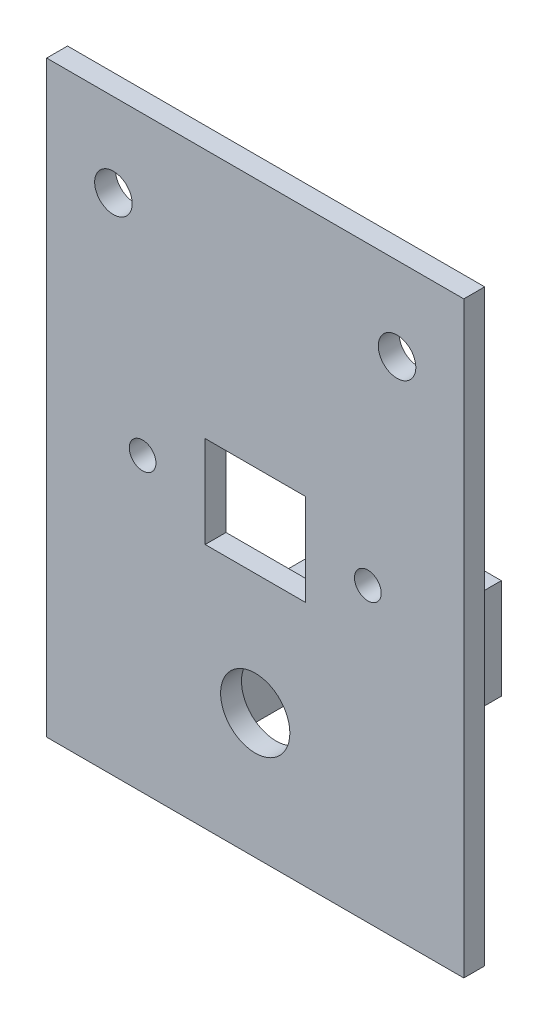
ISO-10303-21;
HEADER;
FILE_DESCRIPTION(('STEP AP214'),'2;1');
FILE_NAME('part.step','',(''),(''),'','','');
FILE_SCHEMA(('AUTOMOTIVE_DESIGN { 1 0 10303 214 1 1 1 1 }'));
ENDSEC;
DATA;
#1=APPLICATION_CONTEXT('core data for automotive mechanical design processes');
#2=APPLICATION_PROTOCOL_DEFINITION('international standard','automotive_design',2000,#1);
#3=PRODUCT_CONTEXT('',#1,'mechanical');
#4=PRODUCT('Part','Part','',(#3));
#5=PRODUCT_RELATED_PRODUCT_CATEGORY('part','',(#4));
#6=PRODUCT_DEFINITION_FORMATION('','',#4);
#7=PRODUCT_DEFINITION_CONTEXT('part definition',#1,'design');
#8=PRODUCT_DEFINITION('design','',#6,#7);
#9=PRODUCT_DEFINITION_SHAPE('','',#8);
#10=(LENGTH_UNIT() NAMED_UNIT(*) SI_UNIT(.MILLI.,.METRE.));
#11=(NAMED_UNIT(*) PLANE_ANGLE_UNIT() SI_UNIT($,.RADIAN.));
#12=(NAMED_UNIT(*) SI_UNIT($,.STERADIAN.) SOLID_ANGLE_UNIT());
#13=UNCERTAINTY_MEASURE_WITH_UNIT(LENGTH_MEASURE(1.E-05),#10,'distance_accuracy_value','');
#14=(GEOMETRIC_REPRESENTATION_CONTEXT(3) GLOBAL_UNCERTAINTY_ASSIGNED_CONTEXT((#13)) GLOBAL_UNIT_ASSIGNED_CONTEXT((#10,
#11,#12)) REPRESENTATION_CONTEXT('',''));
#15=CARTESIAN_POINT('',(0.,0.,0.));
#16=DIRECTION('',(0.,0.,1.));
#17=DIRECTION('',(1.,0.,0.));
#18=AXIS2_PLACEMENT_3D('',#15,#16,#17);
#19=CARTESIAN_POINT('',(0.,0.,0.));
#20=DIRECTION('',(0.,0.,-1.));
#21=DIRECTION('',(-1.,0.,0.));
#22=AXIS2_PLACEMENT_3D('',#19,#20,#21);
#23=PLANE('',#22);
#24=CARTESIAN_POINT('',(13.5,-0.250000000000001,0.));
#25=DIRECTION('',(0.,0.,1.));
#26=DIRECTION('',(1.,0.,0.));
#27=AXIS2_PLACEMENT_3D('',#24,#25,#26);
#28=CIRCLE('',#27,1.6);
#29=CARTESIAN_POINT('',(15.1,-0.250000000000001,0.));
#30=VERTEX_POINT('',#29);
#31=EDGE_CURVE('E231',#30,#30,#28,.T.);
#32=ORIENTED_EDGE('',*,*,#31,.T.);
#33=EDGE_LOOP('',(#32));
#34=FACE_BOUND('',#33,.T.);
#35=DIRECTION('',(1.,0.,0.));
#36=VECTOR('',#35,1.);
#37=CARTESIAN_POINT('',(-5.99999999999997,-5.75,0.));
#38=LINE('',#37,#36);
#39=CARTESIAN_POINT('',(-5.99999999999997,-5.75,0.));
#40=VERTEX_POINT('',#39);
#41=CARTESIAN_POINT('',(6.00000000000003,-5.75,0.));
#42=VERTEX_POINT('',#41);
#43=EDGE_CURVE('E255',#40,#42,#38,.T.);
#44=ORIENTED_EDGE('',*,*,#43,.T.);
#45=DIRECTION('',(0.,1.,0.));
#46=VECTOR('',#45,1.);
#47=CARTESIAN_POINT('',(6.00000000000003,-5.75,0.));
#48=LINE('',#47,#46);
#49=CARTESIAN_POINT('',(6.00000000000002,5.25,0.));
#50=VERTEX_POINT('',#49);
#51=EDGE_CURVE('E247',#42,#50,#48,.T.);
#52=ORIENTED_EDGE('',*,*,#51,.T.);
#53=DIRECTION('',(-1.,0.,0.));
#54=VECTOR('',#53,1.);
#55=CARTESIAN_POINT('',(-5.99999999999998,5.25,0.));
#56=LINE('',#55,#54);
#57=CARTESIAN_POINT('',(-5.99999999999998,5.25,0.));
#58=VERTEX_POINT('',#57);
#59=EDGE_CURVE('E269',#50,#58,#56,.T.);
#60=ORIENTED_EDGE('',*,*,#59,.T.);
#61=DIRECTION('',(0.,-1.,0.));
#62=VECTOR('',#61,1.);
#63=CARTESIAN_POINT('',(-5.99999999999997,-5.75,0.));
#64=LINE('',#63,#62);
#65=EDGE_CURVE('E273',#58,#40,#64,.T.);
#66=ORIENTED_EDGE('',*,*,#65,.T.);
#67=EDGE_LOOP('',(#44,#52,#60,#66));
#68=FACE_BOUND('',#67,.T.);
#69=CARTESIAN_POINT('',(17.,25.25,0.));
#70=DIRECTION('',(0.,0.,1.));
#71=DIRECTION('',(1.,0.,0.));
#72=AXIS2_PLACEMENT_3D('',#69,#70,#71);
#73=CIRCLE('',#72,2.25);
#74=CARTESIAN_POINT('',(19.25,25.25,0.));
#75=VERTEX_POINT('',#74);
#76=EDGE_CURVE('E293',#75,#75,#73,.T.);
#77=ORIENTED_EDGE('',*,*,#76,.T.);
#78=EDGE_LOOP('',(#77));
#79=FACE_BOUND('',#78,.T.);
#80=DIRECTION('',(0.,1.,0.));
#81=VECTOR('',#80,1.);
#82=CARTESIAN_POINT('',(25.,-35.25,0.));
#83=LINE('',#82,#81);
#84=CARTESIAN_POINT('',(25.,-35.25,0.));
#85=VERTEX_POINT('',#84);
#86=CARTESIAN_POINT('',(25.,35.25,0.));
#87=VERTEX_POINT('',#86);
#88=EDGE_CURVE('E306',#85,#87,#83,.T.);
#89=ORIENTED_EDGE('',*,*,#88,.F.);
#90=DIRECTION('',(1.,0.,0.));
#91=VECTOR('',#90,1.);
#92=CARTESIAN_POINT('',(-25.,-35.25,0.));
#93=LINE('',#92,#91);
#94=CARTESIAN_POINT('',(-25.,-35.25,0.));
#95=VERTEX_POINT('',#94);
#96=EDGE_CURVE('E315',#95,#85,#93,.T.);
#97=ORIENTED_EDGE('',*,*,#96,.F.);
#98=DIRECTION('',(0.,-1.,0.));
#99=VECTOR('',#98,1.);
#100=CARTESIAN_POINT('',(-25.,-35.25,0.));
#101=LINE('',#100,#99);
#102=CARTESIAN_POINT('',(-25.,35.25,0.));
#103=VERTEX_POINT('',#102);
#104=EDGE_CURVE('E331',#103,#95,#101,.T.);
#105=ORIENTED_EDGE('',*,*,#104,.F.);
#106=DIRECTION('',(-1.,0.,0.));
#107=VECTOR('',#106,1.);
#108=CARTESIAN_POINT('',(-25.,35.25,0.));
#109=LINE('',#108,#107);
#110=EDGE_CURVE('E328',#87,#103,#109,.T.);
#111=ORIENTED_EDGE('',*,*,#110,.F.);
#112=EDGE_LOOP('',(#89,#97,#105,#111));
#113=FACE_BOUND('',#112,.T.);
#114=CARTESIAN_POINT('',(-17.,25.25,0.));
#115=DIRECTION('',(0.,0.,1.));
#116=DIRECTION('',(1.,0.,0.));
#117=AXIS2_PLACEMENT_3D('',#114,#115,#116);
#118=CIRCLE('',#117,2.25);
#119=CARTESIAN_POINT('',(-14.75,25.25,0.));
#120=VERTEX_POINT('',#119);
#121=EDGE_CURVE('E298',#120,#120,#118,.T.);
#122=ORIENTED_EDGE('',*,*,#121,.T.);
#123=EDGE_LOOP('',(#122));
#124=FACE_BOUND('',#123,.T.);
#125=CARTESIAN_POINT('',(-13.5,-0.250000000000001,0.));
#126=DIRECTION('',(0.,0.,1.));
#127=DIRECTION('',(1.,0.,0.));
#128=AXIS2_PLACEMENT_3D('',#125,#126,#127);
#129=CIRCLE('',#128,1.6);
#130=CARTESIAN_POINT('',(-11.9,-0.250000000000001,0.));
#131=VERTEX_POINT('',#130);
#132=EDGE_CURVE('E239',#131,#131,#129,.T.);
#133=ORIENTED_EDGE('',*,*,#132,.T.);
#134=EDGE_LOOP('',(#133));
#135=FACE_BOUND('',#134,.T.);
#136=CARTESIAN_POINT('',(0.,-20.25,0.));
#137=DIRECTION('',(0.,0.,1.));
#138=DIRECTION('',(1.,0.,0.));
#139=AXIS2_PLACEMENT_3D('',#136,#137,#138);
#140=CIRCLE('',#139,4.15);
#141=CARTESIAN_POINT('',(4.15,-20.25,0.));
#142=VERTEX_POINT('',#141);
#143=EDGE_CURVE('E226',#142,#142,#140,.T.);
#144=ORIENTED_EDGE('',*,*,#143,.T.);
#145=EDGE_LOOP('',(#144));
#146=FACE_BOUND('',#145,.T.);
#147=DIRECTION('',(-1.,0.,0.));
#148=VECTOR('',#147,1.);
#149=CARTESIAN_POINT('',(-7.,-26.25,0.));
#150=LINE('',#149,#148);
#151=CARTESIAN_POINT('',(-5.,-26.25,0.));
#152=VERTEX_POINT('',#151);
#153=CARTESIAN_POINT('',(-7.,-26.25,0.));
#154=VERTEX_POINT('',#153);
#155=EDGE_CURVE('E187',#152,#154,#150,.T.);
#156=ORIENTED_EDGE('',*,*,#155,.F.);
#157=DIRECTION('',(0.,-1.,0.));
#158=VECTOR('',#157,1.);
#159=CARTESIAN_POINT('',(-5.,-26.25,0.));
#160=LINE('',#159,#158);
#161=CARTESIAN_POINT('',(-5.,-14.25,0.));
#162=VERTEX_POINT('',#161);
#163=EDGE_CURVE('E182',#162,#152,#160,.T.);
#164=ORIENTED_EDGE('',*,*,#163,.F.);
#165=DIRECTION('',(1.,0.,0.));
#166=VECTOR('',#165,1.);
#167=CARTESIAN_POINT('',(-5.,-14.25,0.));
#168=LINE('',#167,#166);
#169=CARTESIAN_POINT('',(-7.,-14.25,0.));
#170=VERTEX_POINT('',#169);
#171=EDGE_CURVE('E197',#170,#162,#168,.T.);
#172=ORIENTED_EDGE('',*,*,#171,.F.);
#173=DIRECTION('',(0.,1.,0.));
#174=VECTOR('',#173,1.);
#175=CARTESIAN_POINT('',(-7.,-14.25,0.));
#176=LINE('',#175,#174);
#177=EDGE_CURVE('E209',#154,#170,#176,.T.);
#178=ORIENTED_EDGE('',*,*,#177,.F.);
#179=EDGE_LOOP('',(#156,#164,#172,#178));
#180=FACE_BOUND('',#179,.T.);
#181=DIRECTION('',(0.,-1.,0.));
#182=VECTOR('',#181,1.);
#183=CARTESIAN_POINT('',(7.,-14.25,0.));
#184=LINE('',#183,#182);
#185=CARTESIAN_POINT('',(7.,-14.25,0.));
#186=VERTEX_POINT('',#185);
#187=CARTESIAN_POINT('',(7.,-26.25,0.));
#188=VERTEX_POINT('',#187);
#189=EDGE_CURVE('E607',#186,#188,#184,.T.);
#190=ORIENTED_EDGE('',*,*,#189,.F.);
#191=DIRECTION('',(1.,0.,0.));
#192=VECTOR('',#191,1.);
#193=CARTESIAN_POINT('',(5.,-14.25,0.));
#194=LINE('',#193,#192);
#195=CARTESIAN_POINT('',(5.,-14.25,0.));
#196=VERTEX_POINT('',#195);
#197=EDGE_CURVE('E179',#196,#186,#194,.T.);
#198=ORIENTED_EDGE('',*,*,#197,.F.);
#199=DIRECTION('',(0.,1.,0.));
#200=VECTOR('',#199,1.);
#201=CARTESIAN_POINT('',(5.,-26.25,0.));
#202=LINE('',#201,#200);
#203=CARTESIAN_POINT('',(5.,-26.25,0.));
#204=VERTEX_POINT('',#203);
#205=EDGE_CURVE('E175',#204,#196,#202,.T.);
#206=ORIENTED_EDGE('',*,*,#205,.F.);
#207=DIRECTION('',(-1.,0.,0.));
#208=VECTOR('',#207,1.);
#209=CARTESIAN_POINT('',(7.,-26.25,0.));
#210=LINE('',#209,#208);
#211=EDGE_CURVE('E603',#188,#204,#210,.T.);
#212=ORIENTED_EDGE('',*,*,#211,.F.);
#213=EDGE_LOOP('',(#190,#198,#206,#212));
#214=FACE_BOUND('',#213,.T.);
#215=ADVANCED_FACE('F39',(#34,#68,#79,#113,#124,#135,#146,#180,#214),#23,.T.);
#216=CARTESIAN_POINT('',(0.,0.,2.5));
#217=DIRECTION('',(0.,0.,-1.));
#218=DIRECTION('',(-1.,0.,0.));
#219=AXIS2_PLACEMENT_3D('',#216,#217,#218);
#220=PLANE('',#219);
#221=CARTESIAN_POINT('',(17.,25.25,2.5));
#222=DIRECTION('',(0.,0.,1.));
#223=DIRECTION('',(1.,0.,0.));
#224=AXIS2_PLACEMENT_3D('',#221,#222,#223);
#225=CIRCLE('',#224,2.25);
#226=CARTESIAN_POINT('',(19.25,25.25,2.5));
#227=VERTEX_POINT('',#226);
#228=EDGE_CURVE('E294',#227,#227,#225,.T.);
#229=ORIENTED_EDGE('',*,*,#228,.F.);
#230=EDGE_LOOP('',(#229));
#231=FACE_BOUND('',#230,.T.);
#232=CARTESIAN_POINT('',(-17.,25.25,2.5));
#233=DIRECTION('',(0.,0.,1.));
#234=DIRECTION('',(1.,0.,0.));
#235=AXIS2_PLACEMENT_3D('',#232,#233,#234);
#236=CIRCLE('',#235,2.25);
#237=CARTESIAN_POINT('',(-14.75,25.25,2.5));
#238=VERTEX_POINT('',#237);
#239=EDGE_CURVE('E302',#238,#238,#236,.T.);
#240=ORIENTED_EDGE('',*,*,#239,.F.);
#241=EDGE_LOOP('',(#240));
#242=FACE_BOUND('',#241,.T.);
#243=DIRECTION('',(0.,1.,0.));
#244=VECTOR('',#243,1.);
#245=CARTESIAN_POINT('',(25.,-35.25,2.5));
#246=LINE('',#245,#244);
#247=CARTESIAN_POINT('',(25.,-35.25,2.5));
#248=VERTEX_POINT('',#247);
#249=CARTESIAN_POINT('',(25.,35.25,2.5));
#250=VERTEX_POINT('',#249);
#251=EDGE_CURVE('E310',#248,#250,#246,.T.);
#252=ORIENTED_EDGE('',*,*,#251,.T.);
#253=DIRECTION('',(-1.,0.,0.));
#254=VECTOR('',#253,1.);
#255=CARTESIAN_POINT('',(-25.,35.25,2.5));
#256=LINE('',#255,#254);
#257=CARTESIAN_POINT('',(-25.,35.25,2.5));
#258=VERTEX_POINT('',#257);
#259=EDGE_CURVE('E314',#250,#258,#256,.T.);
#260=ORIENTED_EDGE('',*,*,#259,.T.);
#261=DIRECTION('',(0.,-1.,0.));
#262=VECTOR('',#261,1.);
#263=CARTESIAN_POINT('',(-25.,-35.25,2.5));
#264=LINE('',#263,#262);
#265=CARTESIAN_POINT('',(-25.,-35.25,2.5));
#266=VERTEX_POINT('',#265);
#267=EDGE_CURVE('E318',#258,#266,#264,.T.);
#268=ORIENTED_EDGE('',*,*,#267,.T.);
#269=DIRECTION('',(1.,0.,0.));
#270=VECTOR('',#269,1.);
#271=CARTESIAN_POINT('',(-25.,-35.25,2.5));
#272=LINE('',#271,#270);
#273=EDGE_CURVE('E321',#266,#248,#272,.T.);
#274=ORIENTED_EDGE('',*,*,#273,.T.);
#275=EDGE_LOOP('',(#252,#260,#268,#274));
#276=FACE_BOUND('',#275,.T.);
#277=DIRECTION('',(0.,1.,0.));
#278=VECTOR('',#277,1.);
#279=CARTESIAN_POINT('',(6.00000000000003,-5.75,2.5));
#280=LINE('',#279,#278);
#281=CARTESIAN_POINT('',(6.00000000000003,-5.75,2.5));
#282=VERTEX_POINT('',#281);
#283=CARTESIAN_POINT('',(6.00000000000002,5.25,2.5));
#284=VERTEX_POINT('',#283);
#285=EDGE_CURVE('E251',#282,#284,#280,.T.);
#286=ORIENTED_EDGE('',*,*,#285,.F.);
#287=DIRECTION('',(1.,0.,0.));
#288=VECTOR('',#287,1.);
#289=CARTESIAN_POINT('',(-5.99999999999997,-5.75,2.5));
#290=LINE('',#289,#288);
#291=CARTESIAN_POINT('',(-5.99999999999997,-5.75,2.5));
#292=VERTEX_POINT('',#291);
#293=EDGE_CURVE('E262',#292,#282,#290,.T.);
#294=ORIENTED_EDGE('',*,*,#293,.F.);
#295=DIRECTION('',(0.,-1.,0.));
#296=VECTOR('',#295,1.);
#297=CARTESIAN_POINT('',(-5.99999999999997,-5.75,2.5));
#298=LINE('',#297,#296);
#299=CARTESIAN_POINT('',(-5.99999999999998,5.25,2.5));
#300=VERTEX_POINT('',#299);
#301=EDGE_CURVE('E258',#300,#292,#298,.T.);
#302=ORIENTED_EDGE('',*,*,#301,.F.);
#303=DIRECTION('',(-1.,0.,0.));
#304=VECTOR('',#303,1.);
#305=CARTESIAN_POINT('',(-5.99999999999998,5.25,2.5));
#306=LINE('',#305,#304);
#307=EDGE_CURVE('E254',#284,#300,#306,.T.);
#308=ORIENTED_EDGE('',*,*,#307,.F.);
#309=EDGE_LOOP('',(#286,#294,#302,#308));
#310=FACE_BOUND('',#309,.T.);
#311=CARTESIAN_POINT('',(-13.5,-0.250000000000001,2.5));
#312=DIRECTION('',(0.,0.,1.));
#313=DIRECTION('',(1.,0.,0.));
#314=AXIS2_PLACEMENT_3D('',#311,#312,#313);
#315=CIRCLE('',#314,1.6);
#316=CARTESIAN_POINT('',(-11.9,-0.250000000000001,2.5));
#317=VERTEX_POINT('',#316);
#318=EDGE_CURVE('E243',#317,#317,#315,.T.);
#319=ORIENTED_EDGE('',*,*,#318,.F.);
#320=EDGE_LOOP('',(#319));
#321=FACE_BOUND('',#320,.T.);
#322=CARTESIAN_POINT('',(13.5,-0.250000000000001,2.5));
#323=DIRECTION('',(0.,0.,1.));
#324=DIRECTION('',(1.,0.,0.));
#325=AXIS2_PLACEMENT_3D('',#322,#323,#324);
#326=CIRCLE('',#325,1.6);
#327=CARTESIAN_POINT('',(15.1,-0.250000000000001,2.5));
#328=VERTEX_POINT('',#327);
#329=EDGE_CURVE('E235',#328,#328,#326,.T.);
#330=ORIENTED_EDGE('',*,*,#329,.F.);
#331=EDGE_LOOP('',(#330));
#332=FACE_BOUND('',#331,.T.);
#333=CARTESIAN_POINT('',(0.,-20.25,2.5));
#334=DIRECTION('',(0.,0.,1.));
#335=DIRECTION('',(1.,0.,0.));
#336=AXIS2_PLACEMENT_3D('',#333,#334,#335);
#337=CIRCLE('',#336,4.15);
#338=CARTESIAN_POINT('',(4.15,-20.25,2.5));
#339=VERTEX_POINT('',#338);
#340=EDGE_CURVE('E227',#339,#339,#337,.T.);
#341=ORIENTED_EDGE('',*,*,#340,.F.);
#342=EDGE_LOOP('',(#341));
#343=FACE_BOUND('',#342,.T.);
#344=ADVANCED_FACE('F363',(#231,#242,#276,#310,#321,#332,#343),#220,.F.);
#345=CARTESIAN_POINT('',(25.,-35.25,2.5));
#346=DIRECTION('',(-1.,0.,0.));
#347=DIRECTION('',(0.,0.,1.));
#348=AXIS2_PLACEMENT_3D('',#345,#346,#347);
#349=PLANE('',#348);
#350=ORIENTED_EDGE('',*,*,#88,.T.);
#351=DIRECTION('',(0.,0.,-1.));
#352=VECTOR('',#351,1.);
#353=CARTESIAN_POINT('',(25.,35.25,2.5));
#354=LINE('',#353,#352);
#355=EDGE_CURVE('E11',#250,#87,#354,.T.);
#356=ORIENTED_EDGE('',*,*,#355,.F.);
#357=ORIENTED_EDGE('',*,*,#251,.F.);
#358=DIRECTION('',(0.,0.,-1.));
#359=VECTOR('',#358,1.);
#360=CARTESIAN_POINT('',(25.,-35.25,2.5));
#361=LINE('',#360,#359);
#362=EDGE_CURVE('E324',#248,#85,#361,.T.);
#363=ORIENTED_EDGE('',*,*,#362,.T.);
#364=EDGE_LOOP('',(#350,#356,#357,#363));
#365=FACE_BOUND('',#364,.T.);
#366=ADVANCED_FACE('F41',(#365),#349,.F.);
#367=CARTESIAN_POINT('',(-25.,35.25,2.5));
#368=DIRECTION('',(0.,-1.,0.));
#369=DIRECTION('',(0.,0.,-1.));
#370=AXIS2_PLACEMENT_3D('',#367,#368,#369);
#371=PLANE('',#370);
#372=ORIENTED_EDGE('',*,*,#110,.T.);
#373=DIRECTION('',(0.,0.,-1.));
#374=VECTOR('',#373,1.);
#375=CARTESIAN_POINT('',(-25.,35.25,2.5));
#376=LINE('',#375,#374);
#377=EDGE_CURVE('E48',#258,#103,#376,.T.);
#378=ORIENTED_EDGE('',*,*,#377,.F.);
#379=ORIENTED_EDGE('',*,*,#259,.F.);
#380=ORIENTED_EDGE('',*,*,#355,.T.);
#381=EDGE_LOOP('',(#372,#378,#379,#380));
#382=FACE_BOUND('',#381,.T.);
#383=ADVANCED_FACE('F365',(#382),#371,.F.);
#384=CARTESIAN_POINT('',(-25.,-35.25,2.5));
#385=DIRECTION('',(1.,0.,0.));
#386=DIRECTION('',(0.,0.,-1.));
#387=AXIS2_PLACEMENT_3D('',#384,#385,#386);
#388=PLANE('',#387);
#389=ORIENTED_EDGE('',*,*,#104,.T.);
#390=DIRECTION('',(0.,0.,-1.));
#391=VECTOR('',#390,1.);
#392=CARTESIAN_POINT('',(-25.,-35.25,2.5));
#393=LINE('',#392,#391);
#394=EDGE_CURVE('E339',#266,#95,#393,.T.);
#395=ORIENTED_EDGE('',*,*,#394,.F.);
#396=ORIENTED_EDGE('',*,*,#267,.F.);
#397=ORIENTED_EDGE('',*,*,#377,.T.);
#398=EDGE_LOOP('',(#389,#395,#396,#397));
#399=FACE_BOUND('',#398,.T.);
#400=ADVANCED_FACE('F348',(#399),#388,.F.);
#401=CARTESIAN_POINT('',(-25.,-35.25,2.5));
#402=DIRECTION('',(0.,1.,0.));
#403=DIRECTION('',(0.,0.,1.));
#404=AXIS2_PLACEMENT_3D('',#401,#402,#403);
#405=PLANE('',#404);
#406=ORIENTED_EDGE('',*,*,#96,.T.);
#407=ORIENTED_EDGE('',*,*,#362,.F.);
#408=ORIENTED_EDGE('',*,*,#273,.F.);
#409=ORIENTED_EDGE('',*,*,#394,.T.);
#410=EDGE_LOOP('',(#406,#407,#408,#409));
#411=FACE_BOUND('',#410,.T.);
#412=ADVANCED_FACE('F357',(#411),#405,.F.);
#413=CARTESIAN_POINT('',(-17.,25.25,2.5));
#414=DIRECTION('',(0.,0.,-1.));
#415=DIRECTION('',(-1.,0.,0.));
#416=AXIS2_PLACEMENT_3D('',#413,#414,#415);
#417=CYLINDRICAL_SURFACE('',#416,2.25);
#418=ORIENTED_EDGE('',*,*,#239,.T.);
#419=EDGE_LOOP('',(#418));
#420=FACE_BOUND('',#419,.T.);
#421=ORIENTED_EDGE('',*,*,#121,.F.);
#422=EDGE_LOOP('',(#421));
#423=FACE_BOUND('',#422,.T.);
#424=ADVANCED_FACE('F386',(#420,#423),#417,.F.);
#425=CARTESIAN_POINT('',(17.,25.25,2.5));
#426=DIRECTION('',(0.,0.,-1.));
#427=DIRECTION('',(-1.,0.,0.));
#428=AXIS2_PLACEMENT_3D('',#425,#426,#427);
#429=CYLINDRICAL_SURFACE('',#428,2.25);
#430=ORIENTED_EDGE('',*,*,#228,.T.);
#431=EDGE_LOOP('',(#430));
#432=FACE_BOUND('',#431,.T.);
#433=ORIENTED_EDGE('',*,*,#76,.F.);
#434=EDGE_LOOP('',(#433));
#435=FACE_BOUND('',#434,.T.);
#436=ADVANCED_FACE('F390',(#432,#435),#429,.F.);
#437=CARTESIAN_POINT('',(6.00000000000003,-5.75,2.5));
#438=DIRECTION('',(-1.,0.,0.));
#439=DIRECTION('',(0.,-1.,0.));
#440=AXIS2_PLACEMENT_3D('',#437,#438,#439);
#441=PLANE('',#440);
#442=ORIENTED_EDGE('',*,*,#51,.F.);
#443=DIRECTION('',(0.,0.,-1.));
#444=VECTOR('',#443,1.);
#445=CARTESIAN_POINT('',(6.00000000000003,-5.75,2.5));
#446=LINE('',#445,#444);
#447=EDGE_CURVE('E265',#282,#42,#446,.T.);
#448=ORIENTED_EDGE('',*,*,#447,.F.);
#449=ORIENTED_EDGE('',*,*,#285,.T.);
#450=DIRECTION('',(0.,0.,-1.));
#451=VECTOR('',#450,1.);
#452=CARTESIAN_POINT('',(6.00000000000002,5.25,2.5));
#453=LINE('',#452,#451);
#454=EDGE_CURVE('E289',#284,#50,#453,.T.);
#455=ORIENTED_EDGE('',*,*,#454,.T.);
#456=EDGE_LOOP('',(#442,#448,#449,#455));
#457=FACE_BOUND('',#456,.T.);
#458=ADVANCED_FACE('F395',(#457),#441,.T.);
#459=CARTESIAN_POINT('',(-5.99999999999998,5.25,2.5));
#460=DIRECTION('',(0.,-1.,0.));
#461=DIRECTION('',(0.,0.,-1.));
#462=AXIS2_PLACEMENT_3D('',#459,#460,#461);
#463=PLANE('',#462);
#464=ORIENTED_EDGE('',*,*,#59,.F.);
#465=ORIENTED_EDGE('',*,*,#454,.F.);
#466=ORIENTED_EDGE('',*,*,#307,.T.);
#467=DIRECTION('',(0.,0.,-1.));
#468=VECTOR('',#467,1.);
#469=CARTESIAN_POINT('',(-5.99999999999998,5.25,2.5));
#470=LINE('',#469,#468);
#471=EDGE_CURVE('E286',#300,#58,#470,.T.);
#472=ORIENTED_EDGE('',*,*,#471,.T.);
#473=EDGE_LOOP('',(#464,#465,#466,#472));
#474=FACE_BOUND('',#473,.T.);
#475=ADVANCED_FACE('F402',(#474),#463,.T.);
#476=CARTESIAN_POINT('',(-5.99999999999997,-5.75,2.5));
#477=DIRECTION('',(1.,0.,0.));
#478=DIRECTION('',(0.,1.,0.));
#479=AXIS2_PLACEMENT_3D('',#476,#477,#478);
#480=PLANE('',#479);
#481=ORIENTED_EDGE('',*,*,#65,.F.);
#482=ORIENTED_EDGE('',*,*,#471,.F.);
#483=ORIENTED_EDGE('',*,*,#301,.T.);
#484=DIRECTION('',(0.,0.,-1.));
#485=VECTOR('',#484,1.);
#486=CARTESIAN_POINT('',(-5.99999999999997,-5.75,2.5));
#487=LINE('',#486,#485);
#488=EDGE_CURVE('E283',#292,#40,#487,.T.);
#489=ORIENTED_EDGE('',*,*,#488,.T.);
#490=EDGE_LOOP('',(#481,#482,#483,#489));
#491=FACE_BOUND('',#490,.T.);
#492=ADVANCED_FACE('F406',(#491),#480,.T.);
#493=CARTESIAN_POINT('',(-5.99999999999997,-5.75,2.5));
#494=DIRECTION('',(0.,1.,0.));
#495=DIRECTION('',(0.,0.,1.));
#496=AXIS2_PLACEMENT_3D('',#493,#494,#495);
#497=PLANE('',#496);
#498=ORIENTED_EDGE('',*,*,#43,.F.);
#499=ORIENTED_EDGE('',*,*,#488,.F.);
#500=ORIENTED_EDGE('',*,*,#293,.T.);
#501=ORIENTED_EDGE('',*,*,#447,.T.);
#502=EDGE_LOOP('',(#498,#499,#500,#501));
#503=FACE_BOUND('',#502,.T.);
#504=ADVANCED_FACE('F410',(#503),#497,.T.);
#505=CARTESIAN_POINT('',(-13.5,-0.250000000000001,2.5));
#506=DIRECTION('',(0.,0.,-1.));
#507=DIRECTION('',(-1.,0.,0.));
#508=AXIS2_PLACEMENT_3D('',#505,#506,#507);
#509=CYLINDRICAL_SURFACE('',#508,1.6);
#510=ORIENTED_EDGE('',*,*,#318,.T.);
#511=EDGE_LOOP('',(#510));
#512=FACE_BOUND('',#511,.T.);
#513=ORIENTED_EDGE('',*,*,#132,.F.);
#514=EDGE_LOOP('',(#513));
#515=FACE_BOUND('',#514,.T.);
#516=ADVANCED_FACE('F414',(#512,#515),#509,.F.);
#517=CARTESIAN_POINT('',(13.5,-0.250000000000001,2.5));
#518=DIRECTION('',(0.,0.,-1.));
#519=DIRECTION('',(-1.,0.,0.));
#520=AXIS2_PLACEMENT_3D('',#517,#518,#519);
#521=CYLINDRICAL_SURFACE('',#520,1.6);
#522=ORIENTED_EDGE('',*,*,#329,.T.);
#523=EDGE_LOOP('',(#522));
#524=FACE_BOUND('',#523,.T.);
#525=ORIENTED_EDGE('',*,*,#31,.F.);
#526=EDGE_LOOP('',(#525));
#527=FACE_BOUND('',#526,.T.);
#528=ADVANCED_FACE('F418',(#524,#527),#521,.F.);
#529=CARTESIAN_POINT('',(0.,-20.25,2.5));
#530=DIRECTION('',(0.,0.,-1.));
#531=DIRECTION('',(-1.,0.,0.));
#532=AXIS2_PLACEMENT_3D('',#529,#530,#531);
#533=CYLINDRICAL_SURFACE('',#532,4.15);
#534=ORIENTED_EDGE('',*,*,#340,.T.);
#535=EDGE_LOOP('',(#534));
#536=FACE_BOUND('',#535,.T.);
#537=ORIENTED_EDGE('',*,*,#143,.F.);
#538=EDGE_LOOP('',(#537));
#539=FACE_BOUND('',#538,.T.);
#540=ADVANCED_FACE('F422',(#536,#539),#533,.F.);
#541=CARTESIAN_POINT('',(-5.,-26.25,-20.));
#542=DIRECTION('',(-1.,0.,0.));
#543=DIRECTION('',(0.,0.,1.));
#544=AXIS2_PLACEMENT_3D('',#541,#542,#543);
#545=PLANE('',#544);
#546=ORIENTED_EDGE('',*,*,#163,.T.);
#547=DIRECTION('',(0.,0.,1.));
#548=VECTOR('',#547,1.);
#549=CARTESIAN_POINT('',(-5.,-26.25,-20.));
#550=LINE('',#549,#548);
#551=CARTESIAN_POINT('',(-5.,-26.25,-20.));
#552=VERTEX_POINT('',#551);
#553=EDGE_CURVE('E223',#552,#152,#550,.T.);
#554=ORIENTED_EDGE('',*,*,#553,.F.);
#555=DIRECTION('',(0.,-1.,0.));
#556=VECTOR('',#555,1.);
#557=CARTESIAN_POINT('',(-5.,-26.25,-20.));
#558=LINE('',#557,#556);
#559=CARTESIAN_POINT('',(-5.,-14.25,-20.));
#560=VERTEX_POINT('',#559);
#561=EDGE_CURVE('E192',#560,#552,#558,.T.);
#562=ORIENTED_EDGE('',*,*,#561,.F.);
#563=DIRECTION('',(0.,0.,1.));
#564=VECTOR('',#563,1.);
#565=CARTESIAN_POINT('',(-5.,-14.25,-20.));
#566=LINE('',#565,#564);
#567=EDGE_CURVE('E205',#560,#162,#566,.T.);
#568=ORIENTED_EDGE('',*,*,#567,.T.);
#569=EDGE_LOOP('',(#546,#554,#562,#568));
#570=FACE_BOUND('',#569,.T.);
#571=ADVANCED_FACE('F426',(#570),#545,.F.);
#572=CARTESIAN_POINT('',(-7.,-26.25,-20.));
#573=DIRECTION('',(0.,1.,0.));
#574=DIRECTION('',(0.,0.,1.));
#575=AXIS2_PLACEMENT_3D('',#572,#573,#574);
#576=PLANE('',#575);
#577=ORIENTED_EDGE('',*,*,#155,.T.);
#578=DIRECTION('',(0.,0.,1.));
#579=VECTOR('',#578,1.);
#580=CARTESIAN_POINT('',(-7.,-26.25,-20.));
#581=LINE('',#580,#579);
#582=CARTESIAN_POINT('',(-7.,-26.25,-20.));
#583=VERTEX_POINT('',#582);
#584=EDGE_CURVE('E219',#583,#154,#581,.T.);
#585=ORIENTED_EDGE('',*,*,#584,.F.);
#586=DIRECTION('',(-1.,0.,0.));
#587=VECTOR('',#586,1.);
#588=CARTESIAN_POINT('',(-7.,-26.25,-20.));
#589=LINE('',#588,#587);
#590=EDGE_CURVE('E196',#552,#583,#589,.T.);
#591=ORIENTED_EDGE('',*,*,#590,.F.);
#592=ORIENTED_EDGE('',*,*,#553,.T.);
#593=EDGE_LOOP('',(#577,#585,#591,#592));
#594=FACE_BOUND('',#593,.T.);
#595=ADVANCED_FACE('F430',(#594),#576,.F.);
#596=CARTESIAN_POINT('',(-7.,-14.25,-20.));
#597=DIRECTION('',(1.,0.,0.));
#598=DIRECTION('',(0.,1.,0.));
#599=AXIS2_PLACEMENT_3D('',#596,#597,#598);
#600=PLANE('',#599);
#601=ORIENTED_EDGE('',*,*,#177,.T.);
#602=DIRECTION('',(0.,0.,1.));
#603=VECTOR('',#602,1.);
#604=CARTESIAN_POINT('',(-7.,-14.25,-20.));
#605=LINE('',#604,#603);
#606=CARTESIAN_POINT('',(-7.,-14.25,-20.));
#607=VERTEX_POINT('',#606);
#608=EDGE_CURVE('E63',#607,#170,#605,.T.);
#609=ORIENTED_EDGE('',*,*,#608,.F.);
#610=DIRECTION('',(0.,1.,0.));
#611=VECTOR('',#610,1.);
#612=CARTESIAN_POINT('',(-7.,-14.25,-20.));
#613=LINE('',#612,#611);
#614=EDGE_CURVE('E200',#583,#607,#613,.T.);
#615=ORIENTED_EDGE('',*,*,#614,.F.);
#616=ORIENTED_EDGE('',*,*,#584,.T.);
#617=EDGE_LOOP('',(#601,#609,#615,#616));
#618=FACE_BOUND('',#617,.T.);
#619=ADVANCED_FACE('F434',(#618),#600,.F.);
#620=CARTESIAN_POINT('',(-5.,-14.25,-20.));
#621=DIRECTION('',(0.,-1.,0.));
#622=DIRECTION('',(0.,0.,-1.));
#623=AXIS2_PLACEMENT_3D('',#620,#621,#622);
#624=PLANE('',#623);
#625=ORIENTED_EDGE('',*,*,#171,.T.);
#626=ORIENTED_EDGE('',*,*,#567,.F.);
#627=DIRECTION('',(1.,0.,0.));
#628=VECTOR('',#627,1.);
#629=CARTESIAN_POINT('',(-5.,-14.25,-20.));
#630=LINE('',#629,#628);
#631=EDGE_CURVE('E203',#607,#560,#630,.T.);
#632=ORIENTED_EDGE('',*,*,#631,.F.);
#633=ORIENTED_EDGE('',*,*,#608,.T.);
#634=EDGE_LOOP('',(#625,#626,#632,#633));
#635=FACE_BOUND('',#634,.T.);
#636=ADVANCED_FACE('F438',(#635),#624,.F.);
#637=CARTESIAN_POINT('',(0.,0.,-20.));
#638=DIRECTION('',(0.,0.,1.));
#639=DIRECTION('',(1.,0.,0.));
#640=AXIS2_PLACEMENT_3D('',#637,#638,#639);
#641=PLANE('',#640);
#642=ORIENTED_EDGE('',*,*,#561,.T.);
#643=ORIENTED_EDGE('',*,*,#590,.T.);
#644=ORIENTED_EDGE('',*,*,#614,.T.);
#645=ORIENTED_EDGE('',*,*,#631,.T.);
#646=EDGE_LOOP('',(#642,#643,#644,#645));
#647=FACE_BOUND('',#646,.T.);
#648=ADVANCED_FACE('F442',(#647),#641,.F.);
#649=CARTESIAN_POINT('',(5.,-14.25,-20.));
#650=DIRECTION('',(0.,-1.,0.));
#651=DIRECTION('',(0.,0.,-1.));
#652=AXIS2_PLACEMENT_3D('',#649,#650,#651);
#653=PLANE('',#652);
#654=ORIENTED_EDGE('',*,*,#197,.T.);
#655=DIRECTION('',(0.,0.,1.));
#656=VECTOR('',#655,1.);
#657=CARTESIAN_POINT('',(7.,-14.25,-20.));
#658=LINE('',#657,#656);
#659=CARTESIAN_POINT('',(7.,-14.25,-20.));
#660=VERTEX_POINT('',#659);
#661=EDGE_CURVE('E158',#660,#186,#658,.T.);
#662=ORIENTED_EDGE('',*,*,#661,.F.);
#663=DIRECTION('',(1.,0.,0.));
#664=VECTOR('',#663,1.);
#665=CARTESIAN_POINT('',(5.,-14.25,-20.));
#666=LINE('',#665,#664);
#667=CARTESIAN_POINT('',(5.,-14.25,-20.));
#668=VERTEX_POINT('',#667);
#669=EDGE_CURVE('E166',#668,#660,#666,.T.);
#670=ORIENTED_EDGE('',*,*,#669,.F.);
#671=DIRECTION('',(0.,0.,1.));
#672=VECTOR('',#671,1.);
#673=CARTESIAN_POINT('',(5.,-14.25,-20.));
#674=LINE('',#673,#672);
#675=EDGE_CURVE('E599',#668,#196,#674,.T.);
#676=ORIENTED_EDGE('',*,*,#675,.T.);
#677=EDGE_LOOP('',(#654,#662,#670,#676));
#678=FACE_BOUND('',#677,.T.);
#679=ADVANCED_FACE('F177',(#678),#653,.F.);
#680=CARTESIAN_POINT('',(7.,-14.25,-20.));
#681=DIRECTION('',(-1.,0.,0.));
#682=DIRECTION('',(0.,-1.,0.));
#683=AXIS2_PLACEMENT_3D('',#680,#681,#682);
#684=PLANE('',#683);
#685=ORIENTED_EDGE('',*,*,#189,.T.);
#686=DIRECTION('',(0.,0.,1.));
#687=VECTOR('',#686,1.);
#688=CARTESIAN_POINT('',(7.,-26.25,-20.));
#689=LINE('',#688,#687);
#690=CARTESIAN_POINT('',(7.,-26.25,-20.));
#691=VERTEX_POINT('',#690);
#692=EDGE_CURVE('E161',#691,#188,#689,.T.);
#693=ORIENTED_EDGE('',*,*,#692,.F.);
#694=DIRECTION('',(0.,-1.,0.));
#695=VECTOR('',#694,1.);
#696=CARTESIAN_POINT('',(7.,-14.25,-20.));
#697=LINE('',#696,#695);
#698=EDGE_CURVE('E154',#660,#691,#697,.T.);
#699=ORIENTED_EDGE('',*,*,#698,.F.);
#700=ORIENTED_EDGE('',*,*,#661,.T.);
#701=EDGE_LOOP('',(#685,#693,#699,#700));
#702=FACE_BOUND('',#701,.T.);
#703=ADVANCED_FACE('F156',(#702),#684,.F.);
#704=CARTESIAN_POINT('',(7.,-26.25,-20.));
#705=DIRECTION('',(0.,1.,0.));
#706=DIRECTION('',(0.,0.,1.));
#707=AXIS2_PLACEMENT_3D('',#704,#705,#706);
#708=PLANE('',#707);
#709=ORIENTED_EDGE('',*,*,#211,.T.);
#710=DIRECTION('',(0.,0.,1.));
#711=VECTOR('',#710,1.);
#712=CARTESIAN_POINT('',(5.,-26.25,-20.));
#713=LINE('',#712,#711);
#714=CARTESIAN_POINT('',(5.,-26.25,-20.));
#715=VERTEX_POINT('',#714);
#716=EDGE_CURVE('E55',#715,#204,#713,.T.);
#717=ORIENTED_EDGE('',*,*,#716,.F.);
#718=DIRECTION('',(-1.,0.,0.));
#719=VECTOR('',#718,1.);
#720=CARTESIAN_POINT('',(7.,-26.25,-20.));
#721=LINE('',#720,#719);
#722=EDGE_CURVE('E165',#691,#715,#721,.T.);
#723=ORIENTED_EDGE('',*,*,#722,.F.);
#724=ORIENTED_EDGE('',*,*,#692,.T.);
#725=EDGE_LOOP('',(#709,#717,#723,#724));
#726=FACE_BOUND('',#725,.T.);
#727=ADVANCED_FACE('F450',(#726),#708,.F.);
#728=CARTESIAN_POINT('',(5.,-26.25,-20.));
#729=DIRECTION('',(1.,0.,0.));
#730=DIRECTION('',(0.,0.,-1.));
#731=AXIS2_PLACEMENT_3D('',#728,#729,#730);
#732=PLANE('',#731);
#733=ORIENTED_EDGE('',*,*,#205,.T.);
#734=ORIENTED_EDGE('',*,*,#675,.F.);
#735=DIRECTION('',(0.,1.,0.));
#736=VECTOR('',#735,1.);
#737=CARTESIAN_POINT('',(5.,-26.25,-20.));
#738=LINE('',#737,#736);
#739=EDGE_CURVE('E170',#715,#668,#738,.T.);
#740=ORIENTED_EDGE('',*,*,#739,.F.);
#741=ORIENTED_EDGE('',*,*,#716,.T.);
#742=EDGE_LOOP('',(#733,#734,#740,#741));
#743=FACE_BOUND('',#742,.T.);
#744=ADVANCED_FACE('F453',(#743),#732,.F.);
#745=CARTESIAN_POINT('',(0.,0.,-20.));
#746=DIRECTION('',(0.,0.,-1.));
#747=DIRECTION('',(-1.,0.,0.));
#748=AXIS2_PLACEMENT_3D('',#745,#746,#747);
#749=PLANE('',#748);
#750=ORIENTED_EDGE('',*,*,#669,.T.);
#751=ORIENTED_EDGE('',*,*,#698,.T.);
#752=ORIENTED_EDGE('',*,*,#722,.T.);
#753=ORIENTED_EDGE('',*,*,#739,.T.);
#754=EDGE_LOOP('',(#750,#751,#752,#753));
#755=FACE_BOUND('',#754,.T.);
#756=ADVANCED_FACE('F169',(#755),#749,.T.);
#757=CLOSED_SHELL('',(#215,#344,#366,#383,#400,#412,#424,#436,#458,#475,#492,#504,#516,#528,
#540,#571,#595,#619,#636,#648,#679,#703,#727,#744,#756));
#758=MANIFOLD_SOLID_BREP('B2',#757);
#759=ADVANCED_BREP_SHAPE_REPRESENTATION('',(#18,#758),#14);
#760=SHAPE_DEFINITION_REPRESENTATION(#9,#759);
ENDSEC;
END-ISO-10303-21;
